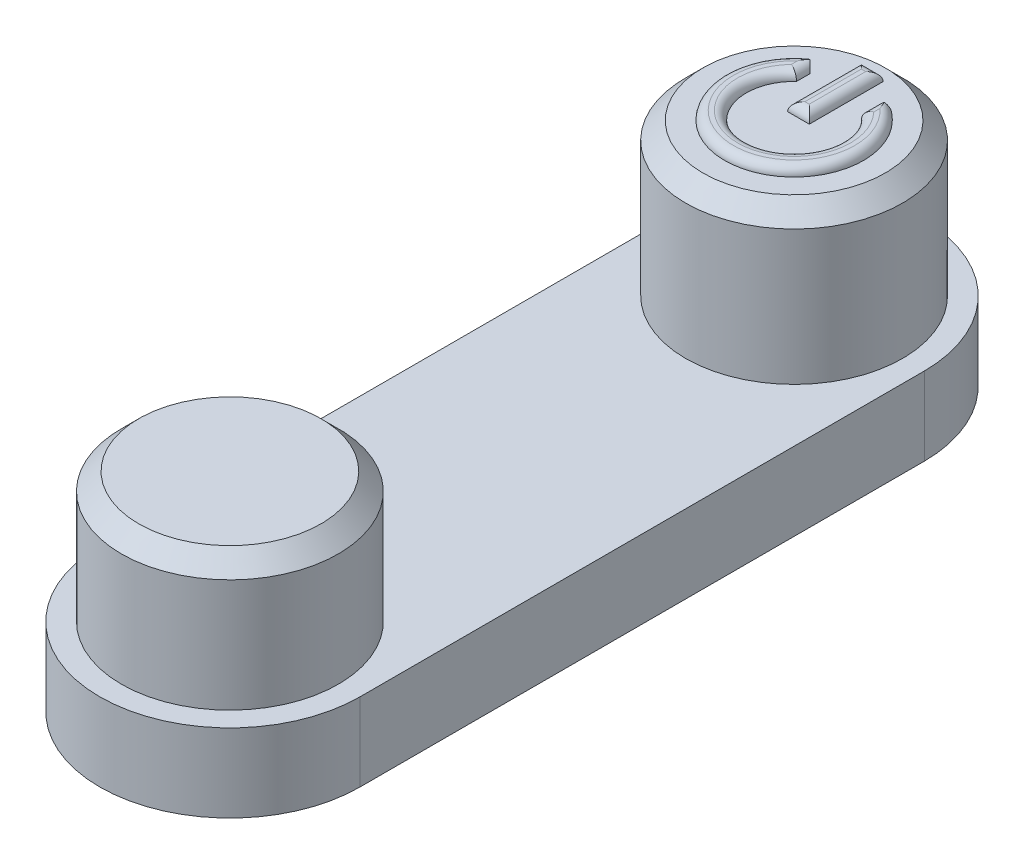
ISO-10303-21;
HEADER;
FILE_DESCRIPTION(('STEP AP214'),'2;1');
FILE_NAME('part.step','',(''),(''),'','','');
FILE_SCHEMA(('AUTOMOTIVE_DESIGN { 1 0 10303 214 1 1 1 1 }'));
ENDSEC;
DATA;
#1=APPLICATION_CONTEXT('core data for automotive mechanical design processes');
#2=APPLICATION_PROTOCOL_DEFINITION('international standard','automotive_design',2000,#1);
#3=PRODUCT_CONTEXT('',#1,'mechanical');
#4=PRODUCT('Part','Part','',(#3));
#5=PRODUCT_RELATED_PRODUCT_CATEGORY('part','',(#4));
#6=PRODUCT_DEFINITION_FORMATION('','',#4);
#7=PRODUCT_DEFINITION_CONTEXT('part definition',#1,'design');
#8=PRODUCT_DEFINITION('design','',#6,#7);
#9=PRODUCT_DEFINITION_SHAPE('','',#8);
#10=(LENGTH_UNIT() NAMED_UNIT(*) SI_UNIT(.MILLI.,.METRE.));
#11=(NAMED_UNIT(*) PLANE_ANGLE_UNIT() SI_UNIT($,.RADIAN.));
#12=(NAMED_UNIT(*) SI_UNIT($,.STERADIAN.) SOLID_ANGLE_UNIT());
#13=UNCERTAINTY_MEASURE_WITH_UNIT(LENGTH_MEASURE(1.E-05),#10,'distance_accuracy_value','');
#14=(GEOMETRIC_REPRESENTATION_CONTEXT(3) GLOBAL_UNCERTAINTY_ASSIGNED_CONTEXT((#13)) GLOBAL_UNIT_ASSIGNED_CONTEXT((#10,
#11,#12)) REPRESENTATION_CONTEXT('',''));
#15=CARTESIAN_POINT('',(0.,0.,0.));
#16=DIRECTION('',(0.,0.,1.));
#17=DIRECTION('',(1.,0.,0.));
#18=AXIS2_PLACEMENT_3D('',#15,#16,#17);
#19=CARTESIAN_POINT('',(0.,5.3,-6.5));
#20=DIRECTION('',(0.,1.,0.));
#21=DIRECTION('',(0.,0.,1.));
#22=AXIS2_PLACEMENT_3D('',#19,#20,#21);
#23=PLANE('',#22);
#24=DIRECTION('',(0.,0.,-1.));
#25=VECTOR('',#24,1.);
#26=CARTESIAN_POINT('',(0.249999999999997,5.3,-6.6));
#27=LINE('',#26,#25);
#28=CARTESIAN_POINT('',(0.249999999999997,5.3,-6.6));
#29=VERTEX_POINT('',#28);
#30=CARTESIAN_POINT('',(0.249999999999997,5.3,-8.3));
#31=VERTEX_POINT('',#30);
#32=EDGE_CURVE('E455',#29,#31,#27,.T.);
#33=ORIENTED_EDGE('',*,*,#32,.F.);
#34=DIRECTION('',(1.,0.,0.));
#35=VECTOR('',#34,1.);
#36=CARTESIAN_POINT('',(-0.250000000000003,5.3,-6.6));
#37=LINE('',#36,#35);
#38=CARTESIAN_POINT('',(-0.250000000000003,5.3,-6.6));
#39=VERTEX_POINT('',#38);
#40=EDGE_CURVE('E437',#39,#29,#37,.T.);
#41=ORIENTED_EDGE('',*,*,#40,.F.);
#42=DIRECTION('',(0.,0.,1.));
#43=VECTOR('',#42,1.);
#44=CARTESIAN_POINT('',(-0.250000000000003,5.3,-6.6));
#45=LINE('',#44,#43);
#46=CARTESIAN_POINT('',(-0.250000000000003,5.3,-8.3));
#47=VERTEX_POINT('',#46);
#48=EDGE_CURVE('E444',#47,#39,#45,.T.);
#49=ORIENTED_EDGE('',*,*,#48,.F.);
#50=DIRECTION('',(-1.,0.,0.));
#51=VECTOR('',#50,1.);
#52=CARTESIAN_POINT('',(-0.250000000000003,5.3,-8.3));
#53=LINE('',#52,#51);
#54=EDGE_CURVE('E449',#31,#47,#53,.T.);
#55=ORIENTED_EDGE('',*,*,#54,.F.);
#56=EDGE_LOOP('',(#33,#41,#49,#55));
#57=FACE_BOUND('',#56,.T.);
#58=CARTESIAN_POINT('',(0.,5.3,-6.5));
#59=DIRECTION('',(0.,1.,0.));
#60=DIRECTION('',(0.,0.,1.));
#61=AXIS2_PLACEMENT_3D('',#58,#59,#60);
#62=CIRCLE('',#61,2.1);
#63=CARTESIAN_POINT('',(0.,5.3,-4.4));
#64=VERTEX_POINT('',#63);
#65=EDGE_CURVE('E330',#64,#64,#62,.T.);
#66=ORIENTED_EDGE('',*,*,#65,.T.);
#67=EDGE_LOOP('',(#66));
#68=FACE_BOUND('',#67,.T.);
#69=DIRECTION('',(0.,0.,1.));
#70=VECTOR('',#69,1.);
#71=CARTESIAN_POINT('',(0.75,5.3,-7.91332940251026));
#72=LINE('',#71,#70);
#73=CARTESIAN_POINT('',(0.75,5.3,-7.69144918424904));
#74=VERTEX_POINT('',#73);
#75=CARTESIAN_POINT('',(0.749999999999999,5.3,-7.30467384697156));
#76=VERTEX_POINT('',#75);
#77=EDGE_CURVE('E162',#74,#76,#72,.T.);
#78=ORIENTED_EDGE('',*,*,#77,.F.);
#79=DIRECTION('',(-0.95606555653458,0.,0.293152949171971));
#80=VECTOR('',#79,1.);
#81=CARTESIAN_POINT('',(0.75,5.3,-7.69144918424904));
#82=LINE('',#81,#80);
#83=CARTESIAN_POINT('',(0.982566843376845,5.3,-7.76275983397337));
#84=VERTEX_POINT('',#83);
#85=EDGE_CURVE('E337',#74,#84,#82,.F.);
#86=ORIENTED_EDGE('',*,*,#85,.T.);
#87=CARTESIAN_POINT('',(0.,5.3,-6.5));
#88=DIRECTION('',(0.,1.,0.));
#89=DIRECTION('',(0.,0.,1.));
#90=AXIS2_PLACEMENT_3D('',#87,#88,#89);
#91=CIRCLE('',#90,1.6);
#92=CARTESIAN_POINT('',(-0.935025916739794,5.3,-7.79835531925006));
#93=VERTEX_POINT('',#92);
#94=EDGE_CURVE('E176',#93,#84,#91,.T.);
#95=ORIENTED_EDGE('',*,*,#94,.F.);
#96=DIRECTION('',(-0.707106781186551,0.,-0.707106781186544));
#97=VECTOR('',#96,1.);
#98=CARTESIAN_POINT('',(-0.935025916739795,5.3,-7.79835531925006));
#99=LINE('',#98,#97);
#100=CARTESIAN_POINT('',(-0.75,5.3,-7.61332940251026));
#101=VERTEX_POINT('',#100);
#102=EDGE_CURVE('E346',#93,#101,#99,.F.);
#103=ORIENTED_EDGE('',*,*,#102,.T.);
#104=DIRECTION('',(0.,0.,-1.));
#105=VECTOR('',#104,1.);
#106=CARTESIAN_POINT('',(-0.75,5.3,-7.91332940251026));
#107=LINE('',#106,#105);
#108=CARTESIAN_POINT('',(-0.75,5.3,-7.30467384697156));
#109=VERTEX_POINT('',#108);
#110=EDGE_CURVE('E165',#109,#101,#107,.T.);
#111=ORIENTED_EDGE('',*,*,#110,.F.);
#112=CARTESIAN_POINT('',(0.,5.3,-6.5));
#113=DIRECTION('',(0.,-1.,0.));
#114=DIRECTION('',(0.,0.,1.));
#115=AXIS2_PLACEMENT_3D('',#112,#113,#114);
#116=CIRCLE('',#115,1.1);
#117=EDGE_CURVE('E159',#76,#109,#116,.T.);
#118=ORIENTED_EDGE('',*,*,#117,.F.);
#119=EDGE_LOOP('',(#78,#86,#95,#103,#111,#118));
#120=FACE_BOUND('',#119,.T.);
#121=ADVANCED_FACE('F51',(#57,#68,#120),#23,.T.);
#122=CARTESIAN_POINT('',(0.,1.8,6.5));
#123=DIRECTION('',(0.,-1.,0.));
#124=DIRECTION('',(0.,0.,-1.));
#125=AXIS2_PLACEMENT_3D('',#122,#123,#124);
#126=CYLINDRICAL_SURFACE('',#125,3.);
#127=CARTESIAN_POINT('',(0.,0.,6.5));
#128=DIRECTION('',(0.,1.,0.));
#129=DIRECTION('',(0.,0.,1.));
#130=AXIS2_PLACEMENT_3D('',#127,#128,#129);
#131=CIRCLE('',#130,3.);
#132=CARTESIAN_POINT('',(-3.,0.,6.5));
#133=VERTEX_POINT('',#132);
#134=CARTESIAN_POINT('',(3.,0.,6.5));
#135=VERTEX_POINT('',#134);
#136=EDGE_CURVE('E419',#133,#135,#131,.T.);
#137=ORIENTED_EDGE('',*,*,#136,.T.);
#138=DIRECTION('',(0.,-1.,0.));
#139=VECTOR('',#138,1.);
#140=CARTESIAN_POINT('',(3.,1.8,6.5));
#141=LINE('',#140,#139);
#142=CARTESIAN_POINT('',(3.,1.8,6.5));
#143=VERTEX_POINT('',#142);
#144=EDGE_CURVE('E397',#143,#135,#141,.T.);
#145=ORIENTED_EDGE('',*,*,#144,.F.);
#146=CARTESIAN_POINT('',(0.,1.8,6.5));
#147=DIRECTION('',(0.,1.,0.));
#148=DIRECTION('',(0.,0.,1.));
#149=AXIS2_PLACEMENT_3D('',#146,#147,#148);
#150=CIRCLE('',#149,3.);
#151=CARTESIAN_POINT('',(-3.,1.8,6.5));
#152=VERTEX_POINT('',#151);
#153=EDGE_CURVE('E404',#152,#143,#150,.T.);
#154=ORIENTED_EDGE('',*,*,#153,.F.);
#155=DIRECTION('',(0.,-1.,0.));
#156=VECTOR('',#155,1.);
#157=CARTESIAN_POINT('',(-3.,1.8,6.5));
#158=LINE('',#157,#156);
#159=EDGE_CURVE('E497',#152,#133,#158,.T.);
#160=ORIENTED_EDGE('',*,*,#159,.T.);
#161=EDGE_LOOP('',(#137,#145,#154,#160));
#162=FACE_BOUND('',#161,.T.);
#163=ADVANCED_FACE('F264',(#162),#126,.T.);
#164=CARTESIAN_POINT('',(3.,1.8,6.5));
#165=DIRECTION('',(-1.,0.,0.));
#166=DIRECTION('',(0.,0.,1.));
#167=AXIS2_PLACEMENT_3D('',#164,#165,#166);
#168=PLANE('',#167);
#169=DIRECTION('',(0.,0.,-1.));
#170=VECTOR('',#169,1.);
#171=CARTESIAN_POINT('',(3.,0.,6.5));
#172=LINE('',#171,#170);
#173=CARTESIAN_POINT('',(3.,0.,-6.5));
#174=VERTEX_POINT('',#173);
#175=EDGE_CURVE('E413',#135,#174,#172,.T.);
#176=ORIENTED_EDGE('',*,*,#175,.T.);
#177=DIRECTION('',(0.,-1.,0.));
#178=VECTOR('',#177,1.);
#179=CARTESIAN_POINT('',(3.,1.8,-6.5));
#180=LINE('',#179,#178);
#181=CARTESIAN_POINT('',(3.,1.8,-6.5));
#182=VERTEX_POINT('',#181);
#183=EDGE_CURVE('E394',#182,#174,#180,.T.);
#184=ORIENTED_EDGE('',*,*,#183,.F.);
#185=DIRECTION('',(0.,0.,-1.));
#186=VECTOR('',#185,1.);
#187=CARTESIAN_POINT('',(3.,1.8,6.5));
#188=LINE('',#187,#186);
#189=EDGE_CURVE('E486',#143,#182,#188,.T.);
#190=ORIENTED_EDGE('',*,*,#189,.F.);
#191=ORIENTED_EDGE('',*,*,#144,.T.);
#192=EDGE_LOOP('',(#176,#184,#190,#191));
#193=FACE_BOUND('',#192,.T.);
#194=ADVANCED_FACE('F269',(#193),#168,.F.);
#195=CARTESIAN_POINT('',(0.,1.8,-6.5));
#196=DIRECTION('',(0.,-1.,0.));
#197=DIRECTION('',(0.,0.,-1.));
#198=AXIS2_PLACEMENT_3D('',#195,#196,#197);
#199=CYLINDRICAL_SURFACE('',#198,3.);
#200=CARTESIAN_POINT('',(0.,0.,-6.5));
#201=DIRECTION('',(0.,1.,0.));
#202=DIRECTION('',(0.,0.,1.));
#203=AXIS2_PLACEMENT_3D('',#200,#201,#202);
#204=CIRCLE('',#203,3.);
#205=CARTESIAN_POINT('',(-3.,0.,-6.5));
#206=VERTEX_POINT('',#205);
#207=EDGE_CURVE('E405',#174,#206,#204,.T.);
#208=ORIENTED_EDGE('',*,*,#207,.T.);
#209=DIRECTION('',(0.,-1.,0.));
#210=VECTOR('',#209,1.);
#211=CARTESIAN_POINT('',(-3.,1.8,-6.5));
#212=LINE('',#211,#210);
#213=CARTESIAN_POINT('',(-3.,1.8,-6.5));
#214=VERTEX_POINT('',#213);
#215=EDGE_CURVE('E383',#214,#206,#212,.T.);
#216=ORIENTED_EDGE('',*,*,#215,.F.);
#217=CARTESIAN_POINT('',(0.,1.8,-6.5));
#218=DIRECTION('',(0.,1.,0.));
#219=DIRECTION('',(0.,0.,1.));
#220=AXIS2_PLACEMENT_3D('',#217,#218,#219);
#221=CIRCLE('',#220,3.);
#222=EDGE_CURVE('E483',#182,#214,#221,.T.);
#223=ORIENTED_EDGE('',*,*,#222,.F.);
#224=ORIENTED_EDGE('',*,*,#183,.T.);
#225=EDGE_LOOP('',(#208,#216,#223,#224));
#226=FACE_BOUND('',#225,.T.);
#227=ADVANCED_FACE('F301',(#226),#199,.T.);
#228=CARTESIAN_POINT('',(-3.,1.8,6.5));
#229=DIRECTION('',(1.,0.,0.));
#230=DIRECTION('',(0.,0.,-1.));
#231=AXIS2_PLACEMENT_3D('',#228,#229,#230);
#232=PLANE('',#231);
#233=DIRECTION('',(0.,0.,1.));
#234=VECTOR('',#233,1.);
#235=CARTESIAN_POINT('',(-3.,0.,6.5));
#236=LINE('',#235,#234);
#237=EDGE_CURVE('E402',#206,#133,#236,.T.);
#238=ORIENTED_EDGE('',*,*,#237,.T.);
#239=ORIENTED_EDGE('',*,*,#159,.F.);
#240=DIRECTION('',(0.,0.,1.));
#241=VECTOR('',#240,1.);
#242=CARTESIAN_POINT('',(-3.,1.8,6.5));
#243=LINE('',#242,#241);
#244=EDGE_CURVE('E485',#214,#152,#243,.T.);
#245=ORIENTED_EDGE('',*,*,#244,.F.);
#246=ORIENTED_EDGE('',*,*,#215,.T.);
#247=EDGE_LOOP('',(#238,#239,#245,#246));
#248=FACE_BOUND('',#247,.T.);
#249=ADVANCED_FACE('F294',(#248),#232,.F.);
#250=CARTESIAN_POINT('',(0.,1.8,6.5));
#251=DIRECTION('',(0.,1.,0.));
#252=DIRECTION('',(0.,0.,1.));
#253=AXIS2_PLACEMENT_3D('',#250,#251,#252);
#254=PLANE('',#253);
#255=CARTESIAN_POINT('',(0.,1.8,6.5));
#256=DIRECTION('',(0.,1.,0.));
#257=DIRECTION('',(0.,0.,1.));
#258=AXIS2_PLACEMENT_3D('',#255,#256,#257);
#259=CIRCLE('',#258,2.5);
#260=CARTESIAN_POINT('',(0.,1.8,9.));
#261=VERTEX_POINT('',#260);
#262=EDGE_CURVE('E431',#261,#261,#259,.T.);
#263=ORIENTED_EDGE('',*,*,#262,.F.);
#264=EDGE_LOOP('',(#263));
#265=FACE_BOUND('',#264,.T.);
#266=CARTESIAN_POINT('',(0.,1.8,-6.5));
#267=DIRECTION('',(0.,1.,0.));
#268=DIRECTION('',(0.,0.,1.));
#269=AXIS2_PLACEMENT_3D('',#266,#267,#268);
#270=CIRCLE('',#269,2.5);
#271=CARTESIAN_POINT('',(0.,1.8,-4.));
#272=VERTEX_POINT('',#271);
#273=EDGE_CURVE('E425',#272,#272,#270,.T.);
#274=ORIENTED_EDGE('',*,*,#273,.F.);
#275=EDGE_LOOP('',(#274));
#276=FACE_BOUND('',#275,.T.);
#277=ORIENTED_EDGE('',*,*,#153,.T.);
#278=ORIENTED_EDGE('',*,*,#189,.T.);
#279=ORIENTED_EDGE('',*,*,#222,.T.);
#280=ORIENTED_EDGE('',*,*,#244,.T.);
#281=EDGE_LOOP('',(#277,#278,#279,#280));
#282=FACE_BOUND('',#281,.T.);
#283=ADVANCED_FACE('F291',(#265,#276,#282),#254,.T.);
#284=CARTESIAN_POINT('',(0.,0.,6.5));
#285=DIRECTION('',(0.,1.,0.));
#286=DIRECTION('',(0.,0.,1.));
#287=AXIS2_PLACEMENT_3D('',#284,#285,#286);
#288=PLANE('',#287);
#289=ORIENTED_EDGE('',*,*,#136,.F.);
#290=ORIENTED_EDGE('',*,*,#237,.F.);
#291=ORIENTED_EDGE('',*,*,#207,.F.);
#292=ORIENTED_EDGE('',*,*,#175,.F.);
#293=EDGE_LOOP('',(#289,#290,#291,#292));
#294=FACE_BOUND('',#293,.T.);
#295=ADVANCED_FACE('F289',(#294),#288,.F.);
#296=CARTESIAN_POINT('',(0.,4.8,-6.5));
#297=DIRECTION('',(0.,-1.,0.));
#298=DIRECTION('',(0.,0.,-1.));
#299=AXIS2_PLACEMENT_3D('',#296,#297,#298);
#300=CYLINDRICAL_SURFACE('',#299,2.5);
#301=CARTESIAN_POINT('',(0.,4.9,-6.5));
#302=DIRECTION('',(0.,1.,0.));
#303=DIRECTION('',(0.,0.,1.));
#304=AXIS2_PLACEMENT_3D('',#301,#302,#303);
#305=CIRCLE('',#304,2.5);
#306=CARTESIAN_POINT('',(0.,4.9,-4.));
#307=VERTEX_POINT('',#306);
#308=EDGE_CURVE('E327',#307,#307,#305,.F.);
#309=ORIENTED_EDGE('',*,*,#308,.T.);
#310=EDGE_LOOP('',(#309));
#311=FACE_BOUND('',#310,.T.);
#312=ORIENTED_EDGE('',*,*,#273,.T.);
#313=EDGE_LOOP('',(#312));
#314=FACE_BOUND('',#313,.T.);
#315=ADVANCED_FACE('F281',(#311,#314),#300,.T.);
#316=CARTESIAN_POINT('',(0.,4.8,6.5));
#317=DIRECTION('',(0.,-1.,0.));
#318=DIRECTION('',(0.,0.,-1.));
#319=AXIS2_PLACEMENT_3D('',#316,#317,#318);
#320=CYLINDRICAL_SURFACE('',#319,2.5);
#321=CARTESIAN_POINT('',(0.,4.4,6.5));
#322=DIRECTION('',(0.,1.,0.));
#323=DIRECTION('',(0.,0.,1.));
#324=AXIS2_PLACEMENT_3D('',#321,#322,#323);
#325=CIRCLE('',#324,2.5);
#326=CARTESIAN_POINT('',(0.,4.4,9.));
#327=VERTEX_POINT('',#326);
#328=EDGE_CURVE('E332',#327,#327,#325,.F.);
#329=ORIENTED_EDGE('',*,*,#328,.T.);
#330=EDGE_LOOP('',(#329));
#331=FACE_BOUND('',#330,.T.);
#332=ORIENTED_EDGE('',*,*,#262,.T.);
#333=EDGE_LOOP('',(#332));
#334=FACE_BOUND('',#333,.T.);
#335=ADVANCED_FACE('F277',(#331,#334),#320,.T.);
#336=CARTESIAN_POINT('',(0.,4.8,6.5));
#337=DIRECTION('',(0.,1.,0.));
#338=DIRECTION('',(0.,0.,1.));
#339=AXIS2_PLACEMENT_3D('',#336,#337,#338);
#340=PLANE('',#339);
#341=CARTESIAN_POINT('',(0.,4.8,6.5));
#342=DIRECTION('',(0.,1.,0.));
#343=DIRECTION('',(0.,0.,1.));
#344=AXIS2_PLACEMENT_3D('',#341,#342,#343);
#345=CIRCLE('',#344,2.10000000000001);
#346=CARTESIAN_POINT('',(0.,4.8,8.6));
#347=VERTEX_POINT('',#346);
#348=EDGE_CURVE('E340',#347,#347,#345,.T.);
#349=ORIENTED_EDGE('',*,*,#348,.T.);
#350=EDGE_LOOP('',(#349));
#351=FACE_BOUND('',#350,.T.);
#352=ADVANCED_FACE('F280',(#351),#340,.T.);
#353=CARTESIAN_POINT('',(0.,4.8,6.5));
#354=DIRECTION('',(0.,-1.,0.));
#355=DIRECTION('',(0.,0.,-1.));
#356=AXIS2_PLACEMENT_3D('',#353,#354,#355);
#357=CONICAL_SURFACE('',#356,2.10000000000001,0.785398163397446);
#358=ORIENTED_EDGE('',*,*,#328,.F.);
#359=EDGE_LOOP('',(#358));
#360=FACE_BOUND('',#359,.T.);
#361=ORIENTED_EDGE('',*,*,#348,.F.);
#362=EDGE_LOOP('',(#361));
#363=FACE_BOUND('',#362,.T.);
#364=ADVANCED_FACE('F285',(#360,#363),#357,.T.);
#365=CARTESIAN_POINT('',(0.,5.3,-6.5));
#366=DIRECTION('',(0.,-1.,0.));
#367=DIRECTION('',(0.,0.,-1.));
#368=AXIS2_PLACEMENT_3D('',#365,#366,#367);
#369=CONICAL_SURFACE('',#368,2.1,0.785398163397448);
#370=ORIENTED_EDGE('',*,*,#308,.F.);
#371=EDGE_LOOP('',(#370));
#372=FACE_BOUND('',#371,.T.);
#373=ORIENTED_EDGE('',*,*,#65,.F.);
#374=EDGE_LOOP('',(#373));
#375=FACE_BOUND('',#374,.T.);
#376=ADVANCED_FACE('F314',(#372,#375),#369,.T.);
#377=CARTESIAN_POINT('',(0.,5.5,0.));
#378=DIRECTION('',(0.,-1.,0.));
#379=DIRECTION('',(0.,0.,-1.));
#380=AXIS2_PLACEMENT_3D('',#377,#378,#379);
#381=PLANE('',#380);
#382=DIRECTION('',(0.,0.,1.));
#383=VECTOR('',#382,1.);
#384=CARTESIAN_POINT('',(-0.0500000000000028,5.5,0.));
#385=LINE('',#384,#383);
#386=CARTESIAN_POINT('',(-0.0500000000000028,5.5,-8.1));
#387=VERTEX_POINT('',#386);
#388=CARTESIAN_POINT('',(-0.0500000000000028,5.5,-6.8));
#389=VERTEX_POINT('',#388);
#390=EDGE_CURVE('E355',#387,#389,#385,.T.);
#391=ORIENTED_EDGE('',*,*,#390,.T.);
#392=DIRECTION('',(1.,0.,0.));
#393=VECTOR('',#392,1.);
#394=CARTESIAN_POINT('',(0.,5.5,-6.8));
#395=LINE('',#394,#393);
#396=CARTESIAN_POINT('',(0.0499999999999972,5.5,-6.8));
#397=VERTEX_POINT('',#396);
#398=EDGE_CURVE('E358',#389,#397,#395,.T.);
#399=ORIENTED_EDGE('',*,*,#398,.T.);
#400=DIRECTION('',(0.,0.,-1.));
#401=VECTOR('',#400,1.);
#402=CARTESIAN_POINT('',(0.0499999999999972,5.5,0.));
#403=LINE('',#402,#401);
#404=CARTESIAN_POINT('',(0.0499999999999972,5.5,-8.1));
#405=VERTEX_POINT('',#404);
#406=EDGE_CURVE('E349',#397,#405,#403,.T.);
#407=ORIENTED_EDGE('',*,*,#406,.T.);
#408=DIRECTION('',(-1.,0.,0.));
#409=VECTOR('',#408,1.);
#410=CARTESIAN_POINT('',(0.,5.5,-8.1));
#411=LINE('',#410,#409);
#412=EDGE_CURVE('E352',#405,#387,#411,.T.);
#413=ORIENTED_EDGE('',*,*,#412,.T.);
#414=EDGE_LOOP('',(#391,#399,#407,#413));
#415=FACE_BOUND('',#414,.T.);
#416=ADVANCED_FACE('F275',(#415),#381,.F.);
#417=CARTESIAN_POINT('',(0.,5.5,-6.5));
#418=DIRECTION('',(0.,1.,0.));
#419=DIRECTION('',(0.,0.,1.));
#420=AXIS2_PLACEMENT_3D('',#417,#418,#419);
#421=PLANE('',#420);
#422=CARTESIAN_POINT('',(0.,5.5,-6.5));
#423=DIRECTION('',(0.,1.,0.));
#424=DIRECTION('',(0.,0.,1.));
#425=AXIS2_PLACEMENT_3D('',#422,#423,#424);
#426=CIRCLE('',#425,1.3);
#427=CARTESIAN_POINT('',(0.95,5.5,-7.38741196746494));
#428=VERTEX_POINT('',#427);
#429=CARTESIAN_POINT('',(-0.95,5.5,-7.38741196746495));
#430=VERTEX_POINT('',#429);
#431=EDGE_CURVE('E179',#428,#430,#426,.F.);
#432=ORIENTED_EDGE('',*,*,#431,.T.);
#433=DIRECTION('',(0.,0.,-1.));
#434=VECTOR('',#433,1.);
#435=CARTESIAN_POINT('',(-0.95,5.5,-7.61332940251026));
#436=LINE('',#435,#434);
#437=CARTESIAN_POINT('',(-0.95,5.5,-7.52834819006016));
#438=VERTEX_POINT('',#437);
#439=EDGE_CURVE('E235',#430,#438,#436,.T.);
#440=ORIENTED_EDGE('',*,*,#439,.T.);
#441=CARTESIAN_POINT('',(0.,5.5,-6.5));
#442=DIRECTION('',(0.,1.,0.));
#443=DIRECTION('',(0.,0.,1.));
#444=AXIS2_PLACEMENT_3D('',#441,#442,#443);
#445=CIRCLE('',#444,1.4);
#446=CARTESIAN_POINT('',(0.95,5.5,-7.52834819006016));
#447=VERTEX_POINT('',#446);
#448=EDGE_CURVE('E362',#438,#447,#445,.T.);
#449=ORIENTED_EDGE('',*,*,#448,.T.);
#450=DIRECTION('',(0.,0.,1.));
#451=VECTOR('',#450,1.);
#452=CARTESIAN_POINT('',(0.95,5.5,-7.30467384697156));
#453=LINE('',#452,#451);
#454=EDGE_CURVE('E365',#447,#428,#453,.T.);
#455=ORIENTED_EDGE('',*,*,#454,.T.);
#456=EDGE_LOOP('',(#432,#440,#449,#455));
#457=FACE_BOUND('',#456,.T.);
#458=ADVANCED_FACE('F322',(#457),#421,.T.);
#459=CARTESIAN_POINT('',(0.75,5.5,-7.69144918424904));
#460=DIRECTION('',(0.293152949171971,0.,0.95606555653458));
#461=DIRECTION('',(0.,-1.,0.));
#462=AXIS2_PLACEMENT_3D('',#459,#460,#461);
#463=PLANE('',#462);
#464=ORIENTED_EDGE('',*,*,#85,.F.);
#465=CARTESIAN_POINT('',(0.95,5.3,-7.75277404783571));
#466=DIRECTION('',(0.293152949171971,0.,0.95606555653458));
#467=DIRECTION('',(0.95606555653458,0.,-0.293152949171971));
#468=AXIS2_PLACEMENT_3D('',#465,#466,#467);
#469=ELLIPSE('',#468,0.209190675924916,0.2);
#470=CARTESIAN_POINT('',(0.856228059622012,5.47665453064475,-7.72402129057602));
#471=VERTEX_POINT('',#470);
#472=EDGE_CURVE('E11',#74,#471,#469,.F.);
#473=ORIENTED_EDGE('',*,*,#472,.T.);
#474=CARTESIAN_POINT('',(0.75,5.49984575130885,-7.69144918424904));
#475=CARTESIAN_POINT('',(0.76609624005352,5.49934385704158,-7.69638468287674));
#476=CARTESIAN_POINT('',(0.782210301079167,5.49761345714971,-7.70132564584787));
#477=CARTESIAN_POINT('',(0.814091166040962,5.49148568201314,-7.7111010943219));
#478=CARTESIAN_POINT('',(0.829854275843458,5.48706758693711,-7.7159344471136));
#479=CARTESIAN_POINT('',(0.857426452775459,5.47649046713087,-7.72438874705931));
#480=CARTESIAN_POINT('',(0.869410012589083,5.47083439136773,-7.72806319791358));
#481=CARTESIAN_POINT('',(0.892326279847834,5.45758796811428,-7.73508988273137));
#482=CARTESIAN_POINT('',(0.903262273966756,5.45000396265727,-7.73844312446901));
#483=CARTESIAN_POINT('',(0.921860567118867,5.43439538340847,-7.7441458134215));
#484=CARTESIAN_POINT('',(0.929760590447352,5.42668159681852,-7.74656815268625));
#485=CARTESIAN_POINT('',(0.944250714595685,5.40998883775815,-7.75101117712));
#486=CARTESIAN_POINT('',(0.950840371164583,5.40100943796654,-7.75303172607086));
#487=CARTESIAN_POINT('',(0.962417880458106,5.38187474794115,-7.75658167196135));
#488=CARTESIAN_POINT('',(0.967392613715577,5.37171069588544,-7.75810704615332));
#489=CARTESIAN_POINT('',(0.975341145491899,5.35056697214336,-7.76054425928781));
#490=CARTESIAN_POINT('',(0.978319505428486,5.33958922386573,-7.76145749687192));
#491=CARTESIAN_POINT('',(0.980982845170334,5.32373167700351,-7.76227414160369));
#492=CARTESIAN_POINT('',(0.981576144419028,5.31900469867468,-7.76245606158116));
#493=CARTESIAN_POINT('',(0.982367944782842,5.30951951461449,-7.76269884682765));
#494=CARTESIAN_POINT('',(0.982566841730616,5.30476134500582,-7.7627598334686));
#495=CARTESIAN_POINT('',(0.982566843377195,5.30000000000006,-7.76275983397348));
#496=B_SPLINE_CURVE_WITH_KNOTS('',3,(#474,#475,#476,#477,#478,#479,#480,#481,#482,#483,#484,
#485,#486,#487,#488,#489,#490,#491,#492,#493,#494,#495),.UNSPECIFIED.,.F.,.F.,(4,2,2,2,2,2,2,2,
2,2,4),(0.,0.0505753948450449,0.101545712668848,0.142643591700841,0.183607987951025,
0.217384741058963,0.251172925979413,0.285229106111935,0.319207205223386,0.333494832136386,
0.347768112334203),.UNSPECIFIED.);
#497=EDGE_CURVE('E66',#471,#84,#496,.T.);
#498=ORIENTED_EDGE('',*,*,#497,.T.);
#499=EDGE_LOOP('',(#464,#473,#498));
#500=FACE_BOUND('',#499,.T.);
#501=ADVANCED_FACE('F246',(#500),#463,.F.);
#502=CARTESIAN_POINT('',(-0.935025916739795,5.5,-7.79835531925006));
#503=DIRECTION('',(-0.707106781186543,0.,0.707106781186551));
#504=DIRECTION('',(0.,-1.,0.));
#505=AXIS2_PLACEMENT_3D('',#502,#503,#504);
#506=PLANE('',#505);
#507=CARTESIAN_POINT('',(-0.935025916739794,5.3,-7.79835531925006));
#508=CARTESIAN_POINT('',(-0.93503305101455,5.31114153424147,-7.79836245352481));
#509=CARTESIAN_POINT('',(-0.934359388853832,5.32227945263819,-7.79768879136409));
#510=CARTESIAN_POINT('',(-0.931703656518709,5.34422726140445,-7.79503305902897));
#511=CARTESIAN_POINT('',(-0.929722968661245,5.355037485725,-7.79305237117151));
#512=CARTESIAN_POINT('',(-0.924505252159181,5.37603761698912,-7.78783465466944));
#513=CARTESIAN_POINT('',(-0.92126778415347,5.38622730555517,-7.78459718666373));
#514=CARTESIAN_POINT('',(-0.913636190992701,5.40569754322009,-7.77696559350296));
#515=CARTESIAN_POINT('',(-0.909242200789586,5.41497819821875,-7.77257160329985));
#516=CARTESIAN_POINT('',(-0.899400100961628,5.43242436097955,-7.76272950347189));
#517=CARTESIAN_POINT('',(-0.893946587484815,5.4405837694456,-7.75727598999508));
#518=CARTESIAN_POINT('',(-0.882158211808288,5.45551237112818,-7.74548761431855));
#519=CARTESIAN_POINT('',(-0.875823184558893,5.46228130341068,-7.73915258706916));
#520=CARTESIAN_POINT('',(-0.862369277943471,5.47432634145328,-7.72569868045373));
#521=CARTESIAN_POINT('',(-0.855241675508672,5.47958295528928,-7.71857107801893));
#522=CARTESIAN_POINT('',(-0.840469272324592,5.48835666681716,-7.70379867483485));
#523=CARTESIAN_POINT('',(-0.832824401307667,5.49187352763318,-7.69615380381793));
#524=CARTESIAN_POINT('',(-0.817116683212894,5.49712025089207,-7.68044608572316));
#525=CARTESIAN_POINT('',(-0.809049359133877,5.49882323338125,-7.67237876164414));
#526=CARTESIAN_POINT('',(-0.792829190551242,5.50030970876978,-7.6561585930615));
#527=CARTESIAN_POINT('',(-0.784676408553887,5.5000945184871,-7.64800581106415));
#528=CARTESIAN_POINT('',(-0.77209221677528,5.49827821824673,-7.63542161928554));
#529=CARTESIAN_POINT('',(-0.767608840414756,5.49733177940373,-7.63093824292502));
#530=CARTESIAN_POINT('',(-0.758731274831206,5.49485871222197,-7.62206067734147));
#531=CARTESIAN_POINT('',(-0.754336938604341,5.49333313923201,-7.6176663411146));
#532=CARTESIAN_POINT('',(-0.749999999999991,5.49152211570197,-7.61332940251025));
#533=B_SPLINE_CURVE_WITH_KNOTS('',3,(#507,#508,#509,#510,#511,#512,#513,#514,#515,#516,#517,
#518,#519,#520,#521,#522,#523,#524,#525,#526,#527,#528,#529,#530,#531,#532),.UNSPECIFIED.,.F.,
.F.,(4,2,2,2,2,2,2,2,2,2,2,2,4),(0.,0.0333786177872813,0.0667219906375336,0.100077030598738,
0.133428180160456,0.166954120005631,0.200486345526825,0.234433160666338,0.268384596559066,
0.302832444270738,0.33725664549459,0.356464166366707,0.375636852341953),.UNSPECIFIED.);
#534=CARTESIAN_POINT('',(-0.857755613531552,5.47745696144433,-7.72108501604181));
#535=VERTEX_POINT('',#534);
#536=EDGE_CURVE('E80',#93,#535,#533,.T.);
#537=ORIENTED_EDGE('',*,*,#536,.T.);
#538=CARTESIAN_POINT('',(-0.95,5.3,-7.81332940251026));
#539=DIRECTION('',(-0.707106781186543,0.,0.707106781186551));
#540=DIRECTION('',(0.707106781186551,0.,0.707106781186544));
#541=AXIS2_PLACEMENT_3D('',#538,#539,#540);
#542=ELLIPSE('',#541,0.282842712474618,0.2);
#543=EDGE_CURVE('E234',#535,#101,#542,.F.);
#544=ORIENTED_EDGE('',*,*,#543,.T.);
#545=ORIENTED_EDGE('',*,*,#102,.F.);
#546=EDGE_LOOP('',(#537,#544,#545));
#547=FACE_BOUND('',#546,.T.);
#548=ADVANCED_FACE('F238',(#547),#506,.F.);
#549=CARTESIAN_POINT('',(0.,5.3,-8.1));
#550=DIRECTION('',(-1.,0.,0.));
#551=DIRECTION('',(0.,0.,1.));
#552=AXIS2_PLACEMENT_3D('',#549,#550,#551);
#553=CYLINDRICAL_SURFACE('',#552,0.2);
#554=CARTESIAN_POINT('',(0.0499999999999972,5.3,-8.1));
#555=DIRECTION('',(-0.707106781186547,0.,-0.707106781186547));
#556=DIRECTION('',(0.707106781186547,0.,-0.707106781186547));
#557=AXIS2_PLACEMENT_3D('',#554,#555,#556);
#558=ELLIPSE('',#557,0.282842712474619,0.2);
#559=EDGE_CURVE('E386',#31,#405,#558,.F.);
#560=ORIENTED_EDGE('',*,*,#559,.F.);
#561=ORIENTED_EDGE('',*,*,#54,.T.);
#562=CARTESIAN_POINT('',(-0.0500000000000028,5.3,-8.1));
#563=DIRECTION('',(-0.707106781186547,0.,0.707106781186547));
#564=DIRECTION('',(-0.707106781186547,0.,-0.707106781186547));
#565=AXIS2_PLACEMENT_3D('',#562,#563,#564);
#566=ELLIPSE('',#565,0.282842712474619,0.2);
#567=EDGE_CURVE('E389',#387,#47,#566,.T.);
#568=ORIENTED_EDGE('',*,*,#567,.F.);
#569=ORIENTED_EDGE('',*,*,#412,.F.);
#570=EDGE_LOOP('',(#560,#561,#568,#569));
#571=FACE_BOUND('',#570,.T.);
#572=ADVANCED_FACE('F213',(#571),#553,.T.);
#573=CARTESIAN_POINT('',(-0.0500000000000028,5.3,0.));
#574=DIRECTION('',(0.,0.,1.));
#575=DIRECTION('',(1.,0.,0.));
#576=AXIS2_PLACEMENT_3D('',#573,#574,#575);
#577=CYLINDRICAL_SURFACE('',#576,0.2);
#578=ORIENTED_EDGE('',*,*,#567,.T.);
#579=ORIENTED_EDGE('',*,*,#48,.T.);
#580=CARTESIAN_POINT('',(-0.0500000000000028,5.3,-6.8));
#581=DIRECTION('',(0.707106781186547,0.,0.707106781186547));
#582=DIRECTION('',(-0.707106781186547,0.,0.707106781186547));
#583=AXIS2_PLACEMENT_3D('',#580,#581,#582);
#584=ELLIPSE('',#583,0.282842712474619,0.2);
#585=EDGE_CURVE('E186',#389,#39,#584,.T.);
#586=ORIENTED_EDGE('',*,*,#585,.F.);
#587=ORIENTED_EDGE('',*,*,#390,.F.);
#588=EDGE_LOOP('',(#578,#579,#586,#587));
#589=FACE_BOUND('',#588,.T.);
#590=ADVANCED_FACE('F255',(#589),#577,.T.);
#591=CARTESIAN_POINT('',(0.0499999999999972,5.3,0.));
#592=DIRECTION('',(0.,0.,-1.));
#593=DIRECTION('',(-1.,0.,0.));
#594=AXIS2_PLACEMENT_3D('',#591,#592,#593);
#595=CYLINDRICAL_SURFACE('',#594,0.2);
#596=ORIENTED_EDGE('',*,*,#559,.T.);
#597=ORIENTED_EDGE('',*,*,#406,.F.);
#598=CARTESIAN_POINT('',(0.0499999999999972,5.3,-6.8));
#599=DIRECTION('',(0.707106781186547,0.,-0.707106781186547));
#600=DIRECTION('',(-0.707106781186547,0.,-0.707106781186547));
#601=AXIS2_PLACEMENT_3D('',#598,#599,#600);
#602=ELLIPSE('',#601,0.282842712474619,0.2);
#603=EDGE_CURVE('E181',#29,#397,#602,.F.);
#604=ORIENTED_EDGE('',*,*,#603,.F.);
#605=ORIENTED_EDGE('',*,*,#32,.T.);
#606=EDGE_LOOP('',(#596,#597,#604,#605));
#607=FACE_BOUND('',#606,.T.);
#608=ADVANCED_FACE('F252',(#607),#595,.T.);
#609=CARTESIAN_POINT('',(0.,5.3,-6.8));
#610=DIRECTION('',(1.,0.,0.));
#611=DIRECTION('',(0.,0.,-1.));
#612=AXIS2_PLACEMENT_3D('',#609,#610,#611);
#613=CYLINDRICAL_SURFACE('',#612,0.2);
#614=ORIENTED_EDGE('',*,*,#585,.T.);
#615=ORIENTED_EDGE('',*,*,#40,.T.);
#616=ORIENTED_EDGE('',*,*,#603,.T.);
#617=ORIENTED_EDGE('',*,*,#398,.F.);
#618=EDGE_LOOP('',(#614,#615,#616,#617));
#619=FACE_BOUND('',#618,.T.);
#620=ADVANCED_FACE('F249',(#619),#613,.T.);
#621=CARTESIAN_POINT('',(0.95,5.3,-6.5));
#622=DIRECTION('',(0.,0.,-1.));
#623=DIRECTION('',(-1.,0.,0.));
#624=AXIS2_PLACEMENT_3D('',#621,#622,#623);
#625=CYLINDRICAL_SURFACE('',#624,0.2);
#626=ORIENTED_EDGE('',*,*,#472,.F.);
#627=ORIENTED_EDGE('',*,*,#77,.T.);
#628=CARTESIAN_POINT('',(0.749999999999999,5.3,-7.30467384697156));
#629=CARTESIAN_POINT('',(0.749987903534372,5.3106000516936,-7.30466764715515));
#630=CARTESIAN_POINT('',(0.750841853312926,5.32119134066007,-7.30504002008231));
#631=CARTESIAN_POINT('',(0.754185896290544,5.3420299438144,-7.30649305424525));
#632=CARTESIAN_POINT('',(0.75667090111401,5.35227822391905,-7.30757151269157));
#633=CARTESIAN_POINT('',(0.763180835953919,5.3721697486493,-7.31038782919714));
#634=CARTESIAN_POINT('',(0.767205134409057,5.38181323952937,-7.31212541681793));
#635=CARTESIAN_POINT('',(0.776638791289912,5.40026600350139,-7.31618091076328));
#636=CARTESIAN_POINT('',(0.782048809287138,5.40907487659116,-7.31849909342639));
#637=CARTESIAN_POINT('',(0.794289027979839,5.42596329403557,-7.32371678105398));
#638=CARTESIAN_POINT('',(0.801163194634069,5.43400536336034,-7.32663414924846));
#639=CARTESIAN_POINT('',(0.815990118530368,5.44883337479445,-7.33288826350667));
#640=CARTESIAN_POINT('',(0.823943260406445,5.4556188669087,-7.33622515909265));
#641=CARTESIAN_POINT('',(0.841366138832099,5.4682962047651,-7.34348708705515));
#642=CARTESIAN_POINT('',(0.850905747283301,5.47407731377812,-7.34743768369358));
#643=CARTESIAN_POINT('',(0.870726163907541,5.48395177008454,-7.35558453449821));
#644=CARTESIAN_POINT('',(0.881007132882542,5.48804474991926,-7.35978084192204));
#645=CARTESIAN_POINT('',(0.900504710199163,5.49400643430469,-7.36767884043936));
#646=CARTESIAN_POINT('',(0.90965700080367,5.49611293649156,-7.37136308384174));
#647=CARTESIAN_POINT('',(0.92814253301677,5.4990213480623,-7.37875672563178));
#648=CARTESIAN_POINT('',(0.93747539220456,5.49982576203182,-7.3824660619118));
#649=CARTESIAN_POINT('',(0.94787706655108,5.49999156743751,-7.38657437710697));
#650=CARTESIAN_POINT('',(0.948938552524406,5.50000002139444,-7.38699332957595));
#651=CARTESIAN_POINT('',(0.95,5.5,-7.38741196746494));
#652=B_SPLINE_CURVE_WITH_KNOTS('',3,(#628,#629,#630,#631,#632,#633,#634,#635,#636,#637,#638,
#639,#640,#641,#642,#643,#644,#645,#646,#647,#648,#649,#650,#651),.UNSPECIFIED.,.F.,.F.,(4,2,2,
2,2,2,2,2,2,2,2,4),(0.,0.031745649942577,0.0633927312409783,0.0950268418693689,
0.126676037698209,0.159460025395799,0.19225573081737,0.227605289057786,0.262962537856177,
0.293147329933811,0.323273991830646,0.326697457284108),.UNSPECIFIED.);
#653=EDGE_CURVE('E56',#428,#76,#652,.F.);
#654=ORIENTED_EDGE('',*,*,#653,.F.);
#655=ORIENTED_EDGE('',*,*,#454,.F.);
#656=CARTESIAN_POINT('',(0.95,5.5,-7.52834819006016));
#657=CARTESIAN_POINT('',(0.949559019132362,5.49999997687101,-7.52935593841877));
#658=CARTESIAN_POINT('',(0.949117467316553,5.49999851943215,-7.53036349876677));
#659=CARTESIAN_POINT('',(0.932859514382189,5.49989164902247,-7.56740720539857));
#660=CARTESIAN_POINT('',(0.916319031782011,5.49793366965117,-7.60319353702378));
#661=CARTESIAN_POINT('',(0.89075349605197,5.49122408794546,-7.65597116950863));
#662=CARTESIAN_POINT('',(0.882111431580928,5.48836172861842,-7.67340289054214));
#663=CARTESIAN_POINT('',(0.864655126040464,5.48112374007996,-7.70785609692896));
#664=CARTESIAN_POINT('',(0.855841062540091,5.47674960092755,-7.7248779686377));
#665=CARTESIAN_POINT('',(0.840571288018854,5.46757577044871,-7.75377977579773));
#666=CARTESIAN_POINT('',(0.834124285992069,5.46321323294714,-7.76580221343101));
#667=CARTESIAN_POINT('',(0.8212757344884,5.4532845560832,-7.7894355073771));
#668=CARTESIAN_POINT('',(0.814874412171449,5.44771440000565,-7.80104483587581));
#669=CARTESIAN_POINT('',(0.801099370931325,5.43394532023546,-7.82571187472979));
#670=CARTESIAN_POINT('',(0.7937690669899,5.4254490683203,-7.83863160711078));
#671=CARTESIAN_POINT('',(0.779881771651285,5.40584346424496,-7.86279063994649));
#672=CARTESIAN_POINT('',(0.773319519092137,5.39475366764915,-7.87404153386678));
#673=CARTESIAN_POINT('',(0.765244414316078,5.37680109438901,-7.88775656859507));
#674=CARTESIAN_POINT('',(0.763020886280857,5.37125224122979,-7.89151485785889));
#675=CARTESIAN_POINT('',(0.758982799088845,5.35958653786458,-7.89831763847568));
#676=CARTESIAN_POINT('',(0.757168166951646,5.3534697892931,-7.90136225720965));
#677=CARTESIAN_POINT('',(0.754062343503921,5.34064868333274,-7.90656103328443));
#678=CARTESIAN_POINT('',(0.752777310379875,5.33393845778424,-7.90870471993916));
#679=CARTESIAN_POINT('',(0.750898022383577,5.32016107043445,-7.9118363404962));
#680=CARTESIAN_POINT('',(0.750302705622376,5.31309447485466,-7.91282605107786));
#681=CARTESIAN_POINT('',(0.749901125116258,5.29969908695093,-7.91349381799548));
#682=CARTESIAN_POINT('',(0.750011605541957,5.29337943353776,-7.91331027027262));
#683=CARTESIAN_POINT('',(0.750817316170696,5.28088245701449,-7.91196991708482));
#684=CARTESIAN_POINT('',(0.751512738312243,5.27470518130683,-7.91081279215733));
#685=CARTESIAN_POINT('',(0.753362730305661,5.26303145386175,-7.90772771903109));
#686=CARTESIAN_POINT('',(0.754487140451383,5.25751640307378,-7.90585036580878));
#687=CARTESIAN_POINT('',(0.757113592412884,5.24684882653478,-7.9014531644655));
#688=CARTESIAN_POINT('',(0.758615734417365,5.24169639742945,-7.89893314588297));
#689=CARTESIAN_POINT('',(0.762991220707239,5.22857223979494,-7.89156818170929));
#690=CARTESIAN_POINT('',(0.766122197556415,5.22093814321433,-7.88627509630428));
#691=CARTESIAN_POINT('',(0.772913013849479,5.20671214642845,-7.87471548954364));
#692=CARTESIAN_POINT('',(0.776574459369795,5.20012354331963,-7.8684460075125));
#693=CARTESIAN_POINT('',(0.786896251482481,5.18360348634133,-7.8506338679605));
#694=CARTESIAN_POINT('',(0.793866242726642,5.17454793310683,-7.83846458525274));
#695=CARTESIAN_POINT('',(0.808207272145788,5.15854420643177,-7.81304611117497));
#696=CARTESIAN_POINT('',(0.815579300004637,5.15160153843883,-7.7997942108055));
#697=CARTESIAN_POINT('',(0.837517801731683,5.13355584782878,-7.75970732346156));
#698=CARTESIAN_POINT('',(0.852261324977316,5.1247721031918,-7.73193576657478));
#699=CARTESIAN_POINT('',(0.881299701792861,5.11149989444215,-7.67524648109737));
#700=CARTESIAN_POINT('',(0.895593891333996,5.10701752257872,-7.64632718705953));
#701=CARTESIAN_POINT('',(0.922951617262479,5.1013635017381,-7.58877308554025));
#702=CARTESIAN_POINT('',(0.936040171017808,5.10008777079417,-7.56016022685971));
#703=CARTESIAN_POINT('',(0.949117455874993,5.10000146917955,-7.53036351994029));
#704=CARTESIAN_POINT('',(0.949559007441412,5.10000001136399,-7.52935596003548));
#705=CARTESIAN_POINT('',(0.95,5.1,-7.52834819006016));
#706=B_SPLINE_CURVE_WITH_KNOTS('',3,(#656,#657,#658,#659,#660,#661,#662,#663,#664,#665,#666,
#667,#668,#669,#670,#671,#672,#673,#674,#675,#676,#677,#678,#679,#680,#681,#682,#683,#684,#685,
#686,#687,#688,#689,#690,#691,#692,#693,#694,#695,#696,#697,#698,#699,#700,#701,#702,#703,#704,
#705),.UNSPECIFIED.,.F.,.F.,(4,2,2,2,2,2,2,2,2,2,2,2,2,2,2,2,2,2,2,2,2,2,2,2,4),(0.,
0.00330019319365117,0.121357592053792,0.180313345795164,0.239211155778968,0.282135277901957,
0.325204424341962,0.376369885954351,0.427161331873952,0.448289051428919,0.469412997081909,
0.49077607721267,0.512106222802412,0.530970710540511,0.549841390749867,0.567576098546197,
0.585315515225215,0.614554727012103,0.643884390451783,0.693682234344977,0.743608744627681,
0.840997804159523,0.938524597980307,1.03284240624018,1.03614259943431),.UNSPECIFIED.);
#707=EDGE_CURVE('E182',#471,#447,#706,.F.);
#708=ORIENTED_EDGE('',*,*,#707,.F.);
#709=EDGE_LOOP('',(#626,#627,#654,#655,#708));
#710=FACE_BOUND('',#709,.T.);
#711=ADVANCED_FACE('F53',(#710),#625,.T.);
#712=CARTESIAN_POINT('',(0.,5.3,-6.5));
#713=DIRECTION('',(0.,1.,0.));
#714=DIRECTION('',(0.,0.,1.));
#715=AXIS2_PLACEMENT_3D('',#712,#713,#714);
#716=TOROIDAL_SURFACE('',#715,1.3,0.2);
#717=ORIENTED_EDGE('',*,*,#653,.T.);
#718=ORIENTED_EDGE('',*,*,#117,.T.);
#719=CARTESIAN_POINT('',(-0.750000000000001,5.3,-7.30467384697156));
#720=CARTESIAN_POINT('',(-0.749987903534373,5.3106000516936,-7.30466764715516));
#721=CARTESIAN_POINT('',(-0.750841853312926,5.32119134066007,-7.30504002008232));
#722=CARTESIAN_POINT('',(-0.754185896290544,5.3420299438144,-7.30649305424526));
#723=CARTESIAN_POINT('',(-0.75667090111401,5.35227822391905,-7.30757151269158));
#724=CARTESIAN_POINT('',(-0.763180835953919,5.3721697486493,-7.31038782919715));
#725=CARTESIAN_POINT('',(-0.767205134409057,5.38181323952937,-7.31212541681793));
#726=CARTESIAN_POINT('',(-0.776638791289912,5.40026600350139,-7.31618091076328));
#727=CARTESIAN_POINT('',(-0.782048809287138,5.40907487659116,-7.31849909342639));
#728=CARTESIAN_POINT('',(-0.794289027979838,5.42596329403557,-7.32371678105399));
#729=CARTESIAN_POINT('',(-0.801163194634068,5.43400536336034,-7.32663414924847));
#730=CARTESIAN_POINT('',(-0.815990118530368,5.44883337479445,-7.33288826350667));
#731=CARTESIAN_POINT('',(-0.823943260406445,5.4556188669087,-7.33622515909265));
#732=CARTESIAN_POINT('',(-0.841366138832099,5.4682962047651,-7.34348708705515));
#733=CARTESIAN_POINT('',(-0.8509057472833,5.47407731377812,-7.34743768369359));
#734=CARTESIAN_POINT('',(-0.870726163907539,5.48395177008454,-7.35558453449822));
#735=CARTESIAN_POINT('',(-0.881007132882541,5.48804474991926,-7.35978084192204));
#736=CARTESIAN_POINT('',(-0.900504710199163,5.49400643430469,-7.36767884043937));
#737=CARTESIAN_POINT('',(-0.90965700080367,5.49611293649156,-7.37136308384174));
#738=CARTESIAN_POINT('',(-0.92814253301677,5.4990213480623,-7.37875672563179));
#739=CARTESIAN_POINT('',(-0.937475392204561,5.49982576203182,-7.3824660619118));
#740=CARTESIAN_POINT('',(-0.947877066551079,5.49999156743751,-7.38657437710698));
#741=CARTESIAN_POINT('',(-0.948938552524406,5.50000002139444,-7.38699332957596));
#742=CARTESIAN_POINT('',(-0.95,5.5,-7.38741196746495));
#743=B_SPLINE_CURVE_WITH_KNOTS('',3,(#719,#720,#721,#722,#723,#724,#725,#726,#727,#728,#729,
#730,#731,#732,#733,#734,#735,#736,#737,#738,#739,#740,#741,#742),.UNSPECIFIED.,.F.,.F.,(4,2,2,
2,2,2,2,2,2,2,2,4),(0.,0.031745649942577,0.0633927312409783,0.095026841869369,0.126676037698209,
0.159460025395799,0.19225573081737,0.227605289057784,0.262962537856177,0.293147329933811,
0.323273991830646,0.326697457284108),.UNSPECIFIED.);
#744=EDGE_CURVE('E189',#430,#109,#743,.F.);
#745=ORIENTED_EDGE('',*,*,#744,.F.);
#746=ORIENTED_EDGE('',*,*,#431,.F.);
#747=EDGE_LOOP('',(#717,#718,#745,#746));
#748=FACE_BOUND('',#747,.T.);
#749=ADVANCED_FACE('F178',(#748),#716,.T.);
#750=CARTESIAN_POINT('',(0.,5.3,-6.5));
#751=DIRECTION('',(0.,1.,0.));
#752=DIRECTION('',(0.,0.,1.));
#753=AXIS2_PLACEMENT_3D('',#750,#751,#752);
#754=TOROIDAL_SURFACE('',#753,1.4,0.2);
#755=ORIENTED_EDGE('',*,*,#707,.T.);
#756=ORIENTED_EDGE('',*,*,#448,.F.);
#757=CARTESIAN_POINT('',(-0.95,5.5,-7.52834819006016));
#758=CARTESIAN_POINT('',(-0.949559019132362,5.49999997687101,-7.52935593841877));
#759=CARTESIAN_POINT('',(-0.949117467316553,5.49999851943215,-7.53036349876677));
#760=CARTESIAN_POINT('',(-0.932859514382191,5.49989164902247,-7.56740720539858));
#761=CARTESIAN_POINT('',(-0.916319031782013,5.49793366965117,-7.60319353702378));
#762=CARTESIAN_POINT('',(-0.890753496051973,5.49122408794546,-7.65597116950863));
#763=CARTESIAN_POINT('',(-0.882111431580931,5.48836172861842,-7.67340289054214));
#764=CARTESIAN_POINT('',(-0.864655126040468,5.48112374007996,-7.70785609692896));
#765=CARTESIAN_POINT('',(-0.855841062540096,5.47674960092755,-7.72487796863769));
#766=CARTESIAN_POINT('',(-0.840571288018858,5.46757577044871,-7.75377977579773));
#767=CARTESIAN_POINT('',(-0.834124285992072,5.46321323294715,-7.76580221343101));
#768=CARTESIAN_POINT('',(-0.821275734488402,5.4532845560832,-7.7894355073771));
#769=CARTESIAN_POINT('',(-0.81487441217145,5.44771440000565,-7.80104483587581));
#770=CARTESIAN_POINT('',(-0.801099370931325,5.43394532023546,-7.82571187472979));
#771=CARTESIAN_POINT('',(-0.7937690669899,5.4254490683203,-7.83863160711078));
#772=CARTESIAN_POINT('',(-0.779881771651285,5.40584346424496,-7.86279063994649));
#773=CARTESIAN_POINT('',(-0.773319519092138,5.39475366764915,-7.87404153386679));
#774=CARTESIAN_POINT('',(-0.765244414316078,5.37680109438901,-7.88775656859507));
#775=CARTESIAN_POINT('',(-0.763020886280857,5.37125224122979,-7.89151485785889));
#776=CARTESIAN_POINT('',(-0.758982799088845,5.35958653786458,-7.89831763847568));
#777=CARTESIAN_POINT('',(-0.757168166951646,5.3534697892931,-7.90136225720966));
#778=CARTESIAN_POINT('',(-0.754062343503921,5.34064868333274,-7.90656103328443));
#779=CARTESIAN_POINT('',(-0.752777310379875,5.33393845778423,-7.90870471993916));
#780=CARTESIAN_POINT('',(-0.750898022383576,5.32016107043445,-7.9118363404962));
#781=CARTESIAN_POINT('',(-0.750302705622376,5.31309447485466,-7.91282605107786));
#782=CARTESIAN_POINT('',(-0.749901125116258,5.29969908695093,-7.91349381799549));
#783=CARTESIAN_POINT('',(-0.750011605541957,5.29337943353775,-7.91331027027262));
#784=CARTESIAN_POINT('',(-0.750817316170696,5.28088245701449,-7.91196991708483));
#785=CARTESIAN_POINT('',(-0.751512738312243,5.27470518130683,-7.91081279215734));
#786=CARTESIAN_POINT('',(-0.75336273030566,5.26303145386175,-7.90772771903109));
#787=CARTESIAN_POINT('',(-0.754487140451383,5.25751640307378,-7.90585036580879));
#788=CARTESIAN_POINT('',(-0.757113592412883,5.24684882653478,-7.9014531644655));
#789=CARTESIAN_POINT('',(-0.758615734417365,5.24169639742945,-7.89893314588298));
#790=CARTESIAN_POINT('',(-0.76299122070724,5.22857223979494,-7.89156818170929));
#791=CARTESIAN_POINT('',(-0.766122197556415,5.22093814321433,-7.88627509630428));
#792=CARTESIAN_POINT('',(-0.772913013849479,5.20671214642845,-7.87471548954365));
#793=CARTESIAN_POINT('',(-0.776574459369795,5.20012354331963,-7.86844600751251));
#794=CARTESIAN_POINT('',(-0.786896251482481,5.18360348634133,-7.85063386796051));
#795=CARTESIAN_POINT('',(-0.793866242726642,5.17454793310683,-7.83846458525274));
#796=CARTESIAN_POINT('',(-0.808207272145789,5.15854420643177,-7.81304611117497));
#797=CARTESIAN_POINT('',(-0.815579300004637,5.15160153843883,-7.7997942108055));
#798=CARTESIAN_POINT('',(-0.837517801731684,5.13355584782878,-7.75970732346156));
#799=CARTESIAN_POINT('',(-0.852261324977318,5.1247721031918,-7.73193576657478));
#800=CARTESIAN_POINT('',(-0.881299701792863,5.11149989444215,-7.67524648109737));
#801=CARTESIAN_POINT('',(-0.895593891333998,5.10701752257872,-7.64632718705953));
#802=CARTESIAN_POINT('',(-0.92295161726248,5.1013635017381,-7.58877308554025));
#803=CARTESIAN_POINT('',(-0.936040171017808,5.10008777079417,-7.56016022685971));
#804=CARTESIAN_POINT('',(-0.949117455874993,5.10000146917955,-7.5303635199403));
#805=CARTESIAN_POINT('',(-0.949559007441412,5.10000001136399,-7.52935596003549));
#806=CARTESIAN_POINT('',(-0.95,5.1,-7.52834819006016));
#807=B_SPLINE_CURVE_WITH_KNOTS('',3,(#757,#758,#759,#760,#761,#762,#763,#764,#765,#766,#767,
#768,#769,#770,#771,#772,#773,#774,#775,#776,#777,#778,#779,#780,#781,#782,#783,#784,#785,#786,
#787,#788,#789,#790,#791,#792,#793,#794,#795,#796,#797,#798,#799,#800,#801,#802,#803,#804,#805,
#806),.UNSPECIFIED.,.F.,.F.,(4,2,2,2,2,2,2,2,2,2,2,2,2,2,2,2,2,2,2,2,2,2,2,2,4),(0.,
0.00330019319365112,0.121357592053786,0.180313345795156,0.239211155778958,0.282135277901951,
0.325204424341961,0.376369885954348,0.427161331873952,0.448289051428917,0.469412997081909,
0.490776077212672,0.512106222802412,0.53097071054051,0.549841390749866,0.567576098546196,
0.585315515225215,0.614554727012102,0.643884390451783,0.693682234344979,0.743608744627683,
0.840997804159525,0.93852459798031,1.03284240624018,1.0361425994343),.UNSPECIFIED.);
#808=EDGE_CURVE('E195',#535,#438,#807,.F.);
#809=ORIENTED_EDGE('',*,*,#808,.F.);
#810=ORIENTED_EDGE('',*,*,#536,.F.);
#811=ORIENTED_EDGE('',*,*,#94,.T.);
#812=ORIENTED_EDGE('',*,*,#497,.F.);
#813=EDGE_LOOP('',(#755,#756,#809,#810,#811,#812));
#814=FACE_BOUND('',#813,.T.);
#815=ADVANCED_FACE('F208',(#814),#754,.T.);
#816=CARTESIAN_POINT('',(-0.95,5.3,-6.5));
#817=DIRECTION('',(0.,0.,1.));
#818=DIRECTION('',(1.,0.,0.));
#819=AXIS2_PLACEMENT_3D('',#816,#817,#818);
#820=CYLINDRICAL_SURFACE('',#819,0.2);
#821=ORIENTED_EDGE('',*,*,#744,.T.);
#822=ORIENTED_EDGE('',*,*,#110,.T.);
#823=ORIENTED_EDGE('',*,*,#543,.F.);
#824=ORIENTED_EDGE('',*,*,#808,.T.);
#825=ORIENTED_EDGE('',*,*,#439,.F.);
#826=EDGE_LOOP('',(#821,#822,#823,#824,#825));
#827=FACE_BOUND('',#826,.T.);
#828=ADVANCED_FACE('F212',(#827),#820,.T.);
#829=CLOSED_SHELL('',(#121,#163,#194,#227,#249,#283,#295,#315,#335,#352,#364,#376,#416,#458,
#501,#548,#572,#590,#608,#620,#711,#749,#815,#828));
#830=MANIFOLD_SOLID_BREP('B2',#829);
#831=ADVANCED_BREP_SHAPE_REPRESENTATION('',(#18,#830),#14);
#832=SHAPE_DEFINITION_REPRESENTATION(#9,#831);
ENDSEC;
END-ISO-10303-21;
